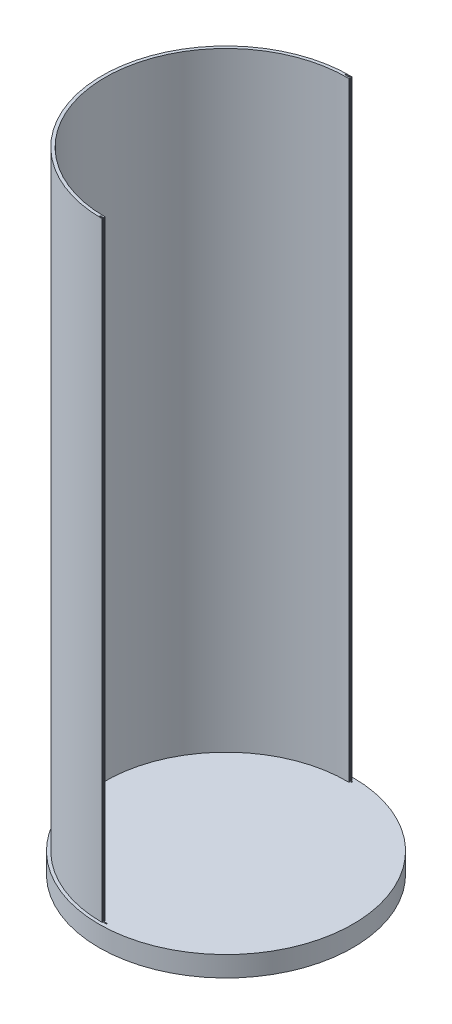
ISO-10303-21;
HEADER;
FILE_DESCRIPTION(('STEP AP214'),'2;1');
FILE_NAME('part.step','',(''),(''),'','','');
FILE_SCHEMA(('AUTOMOTIVE_DESIGN { 1 0 10303 214 1 1 1 1 }'));
ENDSEC;
DATA;
#1=APPLICATION_CONTEXT('core data for automotive mechanical design processes');
#2=APPLICATION_PROTOCOL_DEFINITION('international standard','automotive_design',2000,#1);
#3=PRODUCT_CONTEXT('',#1,'mechanical');
#4=PRODUCT('Part','Part','',(#3));
#5=PRODUCT_RELATED_PRODUCT_CATEGORY('part','',(#4));
#6=PRODUCT_DEFINITION_FORMATION('','',#4);
#7=PRODUCT_DEFINITION_CONTEXT('part definition',#1,'design');
#8=PRODUCT_DEFINITION('design','',#6,#7);
#9=PRODUCT_DEFINITION_SHAPE('','',#8);
#10=(LENGTH_UNIT() NAMED_UNIT(*) SI_UNIT(.MILLI.,.METRE.));
#11=(NAMED_UNIT(*) PLANE_ANGLE_UNIT() SI_UNIT($,.RADIAN.));
#12=(NAMED_UNIT(*) SI_UNIT($,.STERADIAN.) SOLID_ANGLE_UNIT());
#13=UNCERTAINTY_MEASURE_WITH_UNIT(LENGTH_MEASURE(1.E-05),#10,'distance_accuracy_value','');
#14=(GEOMETRIC_REPRESENTATION_CONTEXT(3) GLOBAL_UNCERTAINTY_ASSIGNED_CONTEXT((#13)) GLOBAL_UNIT_ASSIGNED_CONTEXT((#10,
#11,#12)) REPRESENTATION_CONTEXT('',''));
#15=CARTESIAN_POINT('',(0.,0.,0.));
#16=DIRECTION('',(0.,0.,1.));
#17=DIRECTION('',(1.,0.,0.));
#18=AXIS2_PLACEMENT_3D('',#15,#16,#17);
#19=CARTESIAN_POINT('',(0.,10.,0.));
#20=DIRECTION('',(0.,1.,0.));
#21=DIRECTION('',(0.,0.,1.));
#22=AXIS2_PLACEMENT_3D('',#19,#20,#21);
#23=PLANE('',#22);
#24=CARTESIAN_POINT('',(0.,10.,0.));
#25=DIRECTION('',(0.,1.,0.));
#26=DIRECTION('',(0.,0.,1.));
#27=AXIS2_PLACEMENT_3D('',#24,#25,#26);
#28=CIRCLE('',#27,62.5);
#29=CARTESIAN_POINT('',(0.,10.,62.5));
#30=VERTEX_POINT('',#29);
#31=EDGE_CURVE('E267',#30,#30,#28,.T.);
#32=ORIENTED_EDGE('',*,*,#31,.T.);
#33=EDGE_LOOP('',(#32));
#34=FACE_BOUND('',#33,.T.);
#35=DIRECTION('',(-0.0168061206667633,0.,0.999858767180713));
#36=VECTOR('',#35,1.);
#37=CARTESIAN_POINT('',(1.02517336067272,10.,-60.9913847980235));
#38=LINE('',#37,#36);
#39=CARTESIAN_POINT('',(1.02517336067272,10.,-60.9913847980235));
#40=VERTEX_POINT('',#39);
#41=CARTESIAN_POINT('',(1.01895999778819,9.99999999999995,-60.6217286782709));
#42=VERTEX_POINT('',#41);
#43=EDGE_CURVE('E232',#40,#42,#38,.T.);
#44=ORIENTED_EDGE('',*,*,#43,.T.);
#45=DIRECTION('',(1.,0.,0.));
#46=VECTOR('',#45,1.);
#47=CARTESIAN_POINT('',(0.,10.,-60.6217286782709));
#48=LINE('',#47,#46);
#49=CARTESIAN_POINT('',(1.71149518291713,10.,-60.6217286782709));
#50=VERTEX_POINT('',#49);
#51=EDGE_CURVE('E183',#42,#50,#48,.T.);
#52=ORIENTED_EDGE('',*,*,#51,.T.);
#53=DIRECTION('',(0.,0.,1.));
#54=VECTOR('',#53,1.);
#55=CARTESIAN_POINT('',(1.71149518291713,10.,0.));
#56=LINE('',#55,#54);
#57=CARTESIAN_POINT('',(1.71149518291713,10.,-60.1397457254507));
#58=VERTEX_POINT('',#57);
#59=EDGE_CURVE('E186',#50,#58,#56,.T.);
#60=ORIENTED_EDGE('',*,*,#59,.T.);
#61=DIRECTION('',(-1.,0.,0.));
#62=VECTOR('',#61,1.);
#63=CARTESIAN_POINT('',(0.,10.,-60.1397457254507));
#64=LINE('',#63,#62);
#65=CARTESIAN_POINT('',(1.0108585899391,9.99999999999995,-60.1397457254507));
#66=VERTEX_POINT('',#65);
#67=EDGE_CURVE('E177',#58,#66,#64,.T.);
#68=ORIENTED_EDGE('',*,*,#67,.T.);
#69=CARTESIAN_POINT('',(0.999964179672416,10.,-59.4915966472524));
#70=VERTEX_POINT('',#69);
#71=EDGE_CURVE('E252',#66,#70,#38,.T.);
#72=ORIENTED_EDGE('',*,*,#71,.T.);
#73=CARTESIAN_POINT('',(0.,10.,0.));
#74=DIRECTION('',(0.,1.,0.));
#75=DIRECTION('',(0.,0.,1.));
#76=AXIS2_PLACEMENT_3D('',#73,#74,#75);
#77=CIRCLE('',#76,59.5);
#78=CARTESIAN_POINT('',(0.,10.,59.5));
#79=VERTEX_POINT('',#78);
#80=EDGE_CURVE('E250',#70,#79,#77,.T.);
#81=ORIENTED_EDGE('',*,*,#80,.T.);
#82=DIRECTION('',(0.,0.,1.));
#83=VECTOR('',#82,1.);
#84=CARTESIAN_POINT('',(0.,10.,59.5));
#85=LINE('',#84,#83);
#86=CARTESIAN_POINT('',(0.,9.99999999999995,60.1397457254507));
#87=VERTEX_POINT('',#86);
#88=EDGE_CURVE('E247',#79,#87,#85,.T.);
#89=ORIENTED_EDGE('',*,*,#88,.T.);
#90=DIRECTION('',(-1.,0.,0.));
#91=VECTOR('',#90,1.);
#92=CARTESIAN_POINT('',(0.,10.,60.1397457254507));
#93=LINE('',#92,#91);
#94=CARTESIAN_POINT('',(1.71149518291713,10.,60.1397457254507));
#95=VERTEX_POINT('',#94);
#96=EDGE_CURVE('E223',#95,#87,#93,.T.);
#97=ORIENTED_EDGE('',*,*,#96,.F.);
#98=DIRECTION('',(0.,0.,-1.));
#99=VECTOR('',#98,1.);
#100=CARTESIAN_POINT('',(1.71149518291713,10.,0.));
#101=LINE('',#100,#99);
#102=CARTESIAN_POINT('',(1.71149518291713,10.,60.6217286782709));
#103=VERTEX_POINT('',#102);
#104=EDGE_CURVE('E225',#103,#95,#101,.T.);
#105=ORIENTED_EDGE('',*,*,#104,.F.);
#106=DIRECTION('',(1.,0.,0.));
#107=VECTOR('',#106,1.);
#108=CARTESIAN_POINT('',(0.,10.,60.6217286782709));
#109=LINE('',#108,#107);
#110=CARTESIAN_POINT('',(0.,9.99999999999995,60.6217286782709));
#111=VERTEX_POINT('',#110);
#112=EDGE_CURVE('E219',#111,#103,#109,.T.);
#113=ORIENTED_EDGE('',*,*,#112,.F.);
#114=CARTESIAN_POINT('',(-4.5569107396273E-13,10.,61.));
#115=VERTEX_POINT('',#114);
#116=EDGE_CURVE('E246',#111,#115,#85,.T.);
#117=ORIENTED_EDGE('',*,*,#116,.T.);
#118=CARTESIAN_POINT('',(0.,10.,0.));
#119=DIRECTION('',(0.,1.,0.));
#120=DIRECTION('',(1.,0.,0.));
#121=AXIS2_PLACEMENT_3D('',#118,#119,#120);
#122=CIRCLE('',#121,61.);
#123=EDGE_CURVE('E227',#40,#115,#122,.T.);
#124=ORIENTED_EDGE('',*,*,#123,.F.);
#125=EDGE_LOOP('',(#44,#52,#60,#68,#72,#81,#89,#97,#105,#113,#117,#124));
#126=FACE_BOUND('',#125,.T.);
#127=ADVANCED_FACE('F32',(#34,#126),#23,.T.);
#128=CARTESIAN_POINT('',(0.,0.,0.));
#129=DIRECTION('',(0.,1.,0.));
#130=DIRECTION('',(0.,0.,1.));
#131=AXIS2_PLACEMENT_3D('',#128,#129,#130);
#132=PLANE('',#131);
#133=CARTESIAN_POINT('',(0.,0.,0.));
#134=DIRECTION('',(0.,1.,0.));
#135=DIRECTION('',(0.,0.,1.));
#136=AXIS2_PLACEMENT_3D('',#133,#134,#135);
#137=CIRCLE('',#136,62.5);
#138=CARTESIAN_POINT('',(0.,0.,62.5));
#139=VERTEX_POINT('',#138);
#140=EDGE_CURVE('E266',#139,#139,#137,.T.);
#141=ORIENTED_EDGE('',*,*,#140,.F.);
#142=EDGE_LOOP('',(#141));
#143=FACE_BOUND('',#142,.T.);
#144=DIRECTION('',(-1.,0.,0.));
#145=VECTOR('',#144,1.);
#146=CARTESIAN_POINT('',(-1.62574415284666,0.,60.1397457254507));
#147=LINE('',#146,#145);
#148=CARTESIAN_POINT('',(1.71149518291713,0.,60.1397457254507));
#149=VERTEX_POINT('',#148);
#150=CARTESIAN_POINT('',(-1.62574415284666,0.,60.1397457254507));
#151=VERTEX_POINT('',#150);
#152=EDGE_CURVE('E200',#149,#151,#147,.T.);
#153=ORIENTED_EDGE('',*,*,#152,.T.);
#154=DIRECTION('',(0.,0.,1.));
#155=VECTOR('',#154,1.);
#156=CARTESIAN_POINT('',(-1.62574415284666,0.,60.1397457254507));
#157=LINE('',#156,#155);
#158=CARTESIAN_POINT('',(-1.62574415284666,0.,60.6217286782709));
#159=VERTEX_POINT('',#158);
#160=EDGE_CURVE('E190',#151,#159,#157,.T.);
#161=ORIENTED_EDGE('',*,*,#160,.T.);
#162=DIRECTION('',(1.,0.,0.));
#163=VECTOR('',#162,1.);
#164=CARTESIAN_POINT('',(-1.62574415284666,0.,60.6217286782709));
#165=LINE('',#164,#163);
#166=CARTESIAN_POINT('',(1.71149518291713,0.,60.6217286782709));
#167=VERTEX_POINT('',#166);
#168=EDGE_CURVE('E193',#159,#167,#165,.T.);
#169=ORIENTED_EDGE('',*,*,#168,.T.);
#170=DIRECTION('',(0.,0.,-1.));
#171=VECTOR('',#170,1.);
#172=CARTESIAN_POINT('',(1.71149518291713,0.,60.1397457254507));
#173=LINE('',#172,#171);
#174=EDGE_CURVE('E197',#167,#149,#173,.T.);
#175=ORIENTED_EDGE('',*,*,#174,.T.);
#176=EDGE_LOOP('',(#153,#161,#169,#175));
#177=FACE_BOUND('',#176,.T.);
#178=DIRECTION('',(0.,0.,-1.));
#179=VECTOR('',#178,1.);
#180=CARTESIAN_POINT('',(-1.62574415284666,0.,-60.1397457254507));
#181=LINE('',#180,#179);
#182=CARTESIAN_POINT('',(-1.62574415284666,0.,-60.1397457254507));
#183=VERTEX_POINT('',#182);
#184=CARTESIAN_POINT('',(-1.62574415284666,0.,-60.6217286782709));
#185=VERTEX_POINT('',#184);
#186=EDGE_CURVE('E152',#183,#185,#181,.T.);
#187=ORIENTED_EDGE('',*,*,#186,.F.);
#188=DIRECTION('',(-1.,0.,0.));
#189=VECTOR('',#188,1.);
#190=CARTESIAN_POINT('',(-1.62574415284666,0.,-60.1397457254507));
#191=LINE('',#190,#189);
#192=CARTESIAN_POINT('',(1.71149518291713,0.,-60.1397457254507));
#193=VERTEX_POINT('',#192);
#194=EDGE_CURVE('E145',#193,#183,#191,.T.);
#195=ORIENTED_EDGE('',*,*,#194,.F.);
#196=DIRECTION('',(0.,0.,1.));
#197=VECTOR('',#196,1.);
#198=CARTESIAN_POINT('',(1.71149518291713,0.,-60.1397457254507));
#199=LINE('',#198,#197);
#200=CARTESIAN_POINT('',(1.71149518291713,0.,-60.6217286782709));
#201=VERTEX_POINT('',#200);
#202=EDGE_CURVE('E151',#201,#193,#199,.T.);
#203=ORIENTED_EDGE('',*,*,#202,.F.);
#204=DIRECTION('',(1.,0.,0.));
#205=VECTOR('',#204,1.);
#206=CARTESIAN_POINT('',(-1.62574415284666,0.,-60.6217286782709));
#207=LINE('',#206,#205);
#208=EDGE_CURVE('E156',#185,#201,#207,.T.);
#209=ORIENTED_EDGE('',*,*,#208,.F.);
#210=EDGE_LOOP('',(#187,#195,#203,#209));
#211=FACE_BOUND('',#210,.T.);
#212=ADVANCED_FACE('F159',(#143,#177,#211),#132,.F.);
#213=CARTESIAN_POINT('',(1.02517336067272,310.,-60.9913847980235));
#214=DIRECTION('',(0.999858767180712,0.,0.0168061206667633));
#215=DIRECTION('',(0.0168061206667633,0.,-0.999858767180712));
#216=AXIS2_PLACEMENT_3D('',#213,#214,#215);
#217=PLANE('',#216);
#218=DIRECTION('',(-0.0168061206667633,0.,0.999858767180713));
#219=VECTOR('',#218,1.);
#220=CARTESIAN_POINT('',(1.02517336067272,310.,-60.9913847980235));
#221=LINE('',#220,#219);
#222=CARTESIAN_POINT('',(1.02517336067272,310.,-60.9913847980235));
#223=VERTEX_POINT('',#222);
#224=CARTESIAN_POINT('',(1.01895999778819,310.,-60.6217286782709));
#225=VERTEX_POINT('',#224);
#226=EDGE_CURVE('E240',#223,#225,#221,.T.);
#227=ORIENTED_EDGE('',*,*,#226,.T.);
#228=DIRECTION('',(0.,-1.,0.));
#229=VECTOR('',#228,1.);
#230=CARTESIAN_POINT('',(1.01895999778819,310.,-60.6217286782709));
#231=LINE('',#230,#229);
#232=EDGE_CURVE('E180',#225,#42,#231,.T.);
#233=ORIENTED_EDGE('',*,*,#232,.T.);
#234=ORIENTED_EDGE('',*,*,#43,.F.);
#235=DIRECTION('',(0.,-1.,0.));
#236=VECTOR('',#235,1.);
#237=CARTESIAN_POINT('',(1.02517336067272,310.,-60.9913847980235));
#238=LINE('',#237,#236);
#239=EDGE_CURVE('E243',#223,#40,#238,.T.);
#240=ORIENTED_EDGE('',*,*,#239,.F.);
#241=EDGE_LOOP('',(#227,#233,#234,#240));
#242=FACE_BOUND('',#241,.T.);
#243=ADVANCED_FACE('F320',(#242),#217,.T.);
#244=ORIENTED_EDGE('',*,*,#71,.F.);
#245=DIRECTION('',(0.,1.,0.));
#246=VECTOR('',#245,1.);
#247=CARTESIAN_POINT('',(1.0108585899391,310.,-60.1397457254507));
#248=LINE('',#247,#246);
#249=CARTESIAN_POINT('',(1.0108585899391,310.,-60.1397457254507));
#250=VERTEX_POINT('',#249);
#251=EDGE_CURVE('E170',#66,#250,#248,.T.);
#252=ORIENTED_EDGE('',*,*,#251,.T.);
#253=CARTESIAN_POINT('',(0.999964179672573,310.,-59.4915966472524));
#254=VERTEX_POINT('',#253);
#255=EDGE_CURVE('E239',#250,#254,#221,.T.);
#256=ORIENTED_EDGE('',*,*,#255,.T.);
#257=DIRECTION('',(0.,-1.,0.));
#258=VECTOR('',#257,1.);
#259=CARTESIAN_POINT('',(0.999964179672573,310.,-59.4915966472524));
#260=LINE('',#259,#258);
#261=EDGE_CURVE('E257',#254,#70,#260,.T.);
#262=ORIENTED_EDGE('',*,*,#261,.T.);
#263=EDGE_LOOP('',(#244,#252,#256,#262));
#264=FACE_BOUND('',#263,.T.);
#265=ADVANCED_FACE('F312',(#264),#217,.T.);
#266=CARTESIAN_POINT('',(0.,310.,0.));
#267=DIRECTION('',(0.,1.,0.));
#268=DIRECTION('',(1.,0.,0.));
#269=AXIS2_PLACEMENT_3D('',#266,#267,#268);
#270=PLANE('',#269);
#271=DIRECTION('',(0.,0.,-1.));
#272=VECTOR('',#271,1.);
#273=CARTESIAN_POINT('',(-1.62574415284666,310.,-60.1397457254507));
#274=LINE('',#273,#272);
#275=CARTESIAN_POINT('',(-1.62574415284666,310.,-60.1397457254507));
#276=VERTEX_POINT('',#275);
#277=CARTESIAN_POINT('',(-1.62574415284666,310.,-60.6217286782709));
#278=VERTEX_POINT('',#277);
#279=EDGE_CURVE('E55',#276,#278,#274,.T.);
#280=ORIENTED_EDGE('',*,*,#279,.T.);
#281=DIRECTION('',(1.,0.,0.));
#282=VECTOR('',#281,1.);
#283=CARTESIAN_POINT('',(-1.62574415284666,310.,-60.6217286782709));
#284=LINE('',#283,#282);
#285=EDGE_CURVE('E160',#278,#225,#284,.T.);
#286=ORIENTED_EDGE('',*,*,#285,.T.);
#287=ORIENTED_EDGE('',*,*,#226,.F.);
#288=CARTESIAN_POINT('',(0.,310.,0.));
#289=DIRECTION('',(0.,1.,0.));
#290=DIRECTION('',(1.,0.,0.));
#291=AXIS2_PLACEMENT_3D('',#288,#289,#290);
#292=CIRCLE('',#291,61.);
#293=CARTESIAN_POINT('',(0.,310.,61.));
#294=VERTEX_POINT('',#293);
#295=EDGE_CURVE('E228',#223,#294,#292,.T.);
#296=ORIENTED_EDGE('',*,*,#295,.T.);
#297=DIRECTION('',(0.,0.,1.));
#298=VECTOR('',#297,1.);
#299=CARTESIAN_POINT('',(0.,310.,59.5));
#300=LINE('',#299,#298);
#301=CARTESIAN_POINT('',(0.,310.,60.6217286782709));
#302=VERTEX_POINT('',#301);
#303=EDGE_CURVE('E231',#302,#294,#300,.T.);
#304=ORIENTED_EDGE('',*,*,#303,.F.);
#305=DIRECTION('',(1.,0.,0.));
#306=VECTOR('',#305,1.);
#307=CARTESIAN_POINT('',(-1.62574415284666,310.,60.6217286782709));
#308=LINE('',#307,#306);
#309=CARTESIAN_POINT('',(-1.62574415284666,310.,60.6217286782709));
#310=VERTEX_POINT('',#309);
#311=EDGE_CURVE('E194',#310,#302,#308,.T.);
#312=ORIENTED_EDGE('',*,*,#311,.F.);
#313=DIRECTION('',(0.,0.,1.));
#314=VECTOR('',#313,1.);
#315=CARTESIAN_POINT('',(-1.62574415284666,310.,60.1397457254507));
#316=LINE('',#315,#314);
#317=CARTESIAN_POINT('',(-1.62574415284666,310.,60.1397457254507));
#318=VERTEX_POINT('',#317);
#319=EDGE_CURVE('E189',#318,#310,#316,.T.);
#320=ORIENTED_EDGE('',*,*,#319,.F.);
#321=DIRECTION('',(-1.,0.,0.));
#322=VECTOR('',#321,1.);
#323=CARTESIAN_POINT('',(0.,310.,60.1397457254507));
#324=LINE('',#323,#322);
#325=CARTESIAN_POINT('',(0.,310.,60.1397457254507));
#326=VERTEX_POINT('',#325);
#327=EDGE_CURVE('E40',#326,#318,#324,.T.);
#328=ORIENTED_EDGE('',*,*,#327,.F.);
#329=CARTESIAN_POINT('',(0.,310.,59.5));
#330=VERTEX_POINT('',#329);
#331=EDGE_CURVE('E233',#330,#326,#300,.T.);
#332=ORIENTED_EDGE('',*,*,#331,.F.);
#333=CARTESIAN_POINT('',(0.,310.,0.));
#334=DIRECTION('',(0.,1.,0.));
#335=DIRECTION('',(0.,0.,1.));
#336=AXIS2_PLACEMENT_3D('',#333,#334,#335);
#337=CIRCLE('',#336,59.5);
#338=EDGE_CURVE('E236',#254,#330,#337,.T.);
#339=ORIENTED_EDGE('',*,*,#338,.F.);
#340=ORIENTED_EDGE('',*,*,#255,.F.);
#341=DIRECTION('',(-1.,0.,0.));
#342=VECTOR('',#341,1.);
#343=CARTESIAN_POINT('',(0.,310.,-60.1397457254507));
#344=LINE('',#343,#342);
#345=EDGE_CURVE('E11',#250,#276,#344,.T.);
#346=ORIENTED_EDGE('',*,*,#345,.T.);
#347=EDGE_LOOP('',(#280,#286,#287,#296,#304,#312,#320,#328,#332,#339,#340,#346));
#348=FACE_BOUND('',#347,.T.);
#349=ADVANCED_FACE('F283',(#348),#270,.T.);
#350=CARTESIAN_POINT('',(0.,310.,59.5));
#351=DIRECTION('',(1.,0.,0.));
#352=DIRECTION('',(0.,0.,-1.));
#353=AXIS2_PLACEMENT_3D('',#350,#351,#352);
#354=PLANE('',#353);
#355=DIRECTION('',(0.,1.,0.));
#356=VECTOR('',#355,1.);
#357=CARTESIAN_POINT('',(0.,310.,60.1397457254507));
#358=LINE('',#357,#356);
#359=EDGE_CURVE('E221',#87,#326,#358,.T.);
#360=ORIENTED_EDGE('',*,*,#359,.F.);
#361=ORIENTED_EDGE('',*,*,#88,.F.);
#362=DIRECTION('',(0.,-1.,0.));
#363=VECTOR('',#362,1.);
#364=CARTESIAN_POINT('',(0.,310.,59.5));
#365=LINE('',#364,#363);
#366=EDGE_CURVE('E260',#330,#79,#365,.T.);
#367=ORIENTED_EDGE('',*,*,#366,.F.);
#368=ORIENTED_EDGE('',*,*,#331,.T.);
#369=EDGE_LOOP('',(#360,#361,#367,#368));
#370=FACE_BOUND('',#369,.T.);
#371=ADVANCED_FACE('F304',(#370),#354,.T.);
#372=CARTESIAN_POINT('',(0.,10.,0.));
#373=DIRECTION('',(0.,-1.,0.));
#374=DIRECTION('',(0.,0.,-1.));
#375=AXIS2_PLACEMENT_3D('',#372,#373,#374);
#376=CYLINDRICAL_SURFACE('',#375,62.5);
#377=ORIENTED_EDGE('',*,*,#31,.F.);
#378=EDGE_LOOP('',(#377));
#379=FACE_BOUND('',#378,.T.);
#380=ORIENTED_EDGE('',*,*,#140,.T.);
#381=EDGE_LOOP('',(#380));
#382=FACE_BOUND('',#381,.T.);
#383=ADVANCED_FACE('F34',(#379,#382),#376,.T.);
#384=CARTESIAN_POINT('',(0.,310.,0.));
#385=DIRECTION('',(0.,-1.,0.));
#386=DIRECTION('',(0.,0.,-1.));
#387=AXIS2_PLACEMENT_3D('',#384,#385,#386);
#388=CYLINDRICAL_SURFACE('',#387,61.);
#389=ORIENTED_EDGE('',*,*,#123,.T.);
#390=DIRECTION('',(0.,-1.,0.));
#391=VECTOR('',#390,1.);
#392=CARTESIAN_POINT('',(0.,310.,61.));
#393=LINE('',#392,#391);
#394=EDGE_CURVE('E263',#294,#115,#393,.T.);
#395=ORIENTED_EDGE('',*,*,#394,.F.);
#396=ORIENTED_EDGE('',*,*,#295,.F.);
#397=ORIENTED_EDGE('',*,*,#239,.T.);
#398=EDGE_LOOP('',(#389,#395,#396,#397));
#399=FACE_BOUND('',#398,.T.);
#400=ADVANCED_FACE('F324',(#399),#388,.T.);
#401=DIRECTION('',(0.,-1.,0.));
#402=VECTOR('',#401,1.);
#403=CARTESIAN_POINT('',(0.,310.,60.6217286782709));
#404=LINE('',#403,#402);
#405=EDGE_CURVE('E209',#302,#111,#404,.T.);
#406=ORIENTED_EDGE('',*,*,#405,.F.);
#407=ORIENTED_EDGE('',*,*,#303,.T.);
#408=ORIENTED_EDGE('',*,*,#394,.T.);
#409=ORIENTED_EDGE('',*,*,#116,.F.);
#410=EDGE_LOOP('',(#406,#407,#408,#409));
#411=FACE_BOUND('',#410,.T.);
#412=ADVANCED_FACE('F292',(#411),#354,.T.);
#413=CARTESIAN_POINT('',(0.,310.,0.));
#414=DIRECTION('',(0.,-1.,0.));
#415=DIRECTION('',(0.,0.,-1.));
#416=AXIS2_PLACEMENT_3D('',#413,#414,#415);
#417=CYLINDRICAL_SURFACE('',#416,59.5);
#418=ORIENTED_EDGE('',*,*,#80,.F.);
#419=ORIENTED_EDGE('',*,*,#261,.F.);
#420=ORIENTED_EDGE('',*,*,#338,.T.);
#421=ORIENTED_EDGE('',*,*,#366,.T.);
#422=EDGE_LOOP('',(#418,#419,#420,#421));
#423=FACE_BOUND('',#422,.T.);
#424=ADVANCED_FACE('F309',(#423),#417,.F.);
#425=CARTESIAN_POINT('',(-1.62574415284666,0.,60.1397457254507));
#426=DIRECTION('',(-1.,0.,0.));
#427=DIRECTION('',(0.,0.,1.));
#428=AXIS2_PLACEMENT_3D('',#425,#426,#427);
#429=PLANE('',#428);
#430=ORIENTED_EDGE('',*,*,#319,.T.);
#431=DIRECTION('',(0.,1.,0.));
#432=VECTOR('',#431,1.);
#433=CARTESIAN_POINT('',(-1.62574415284666,0.,60.6217286782709));
#434=LINE('',#433,#432);
#435=EDGE_CURVE('E203',#159,#310,#434,.T.);
#436=ORIENTED_EDGE('',*,*,#435,.F.);
#437=ORIENTED_EDGE('',*,*,#160,.F.);
#438=DIRECTION('',(0.,1.,0.));
#439=VECTOR('',#438,1.);
#440=CARTESIAN_POINT('',(-1.62574415284666,0.,60.1397457254507));
#441=LINE('',#440,#439);
#442=EDGE_CURVE('E206',#151,#318,#441,.T.);
#443=ORIENTED_EDGE('',*,*,#442,.T.);
#444=EDGE_LOOP('',(#430,#436,#437,#443));
#445=FACE_BOUND('',#444,.T.);
#446=ADVANCED_FACE('F281',(#445),#429,.F.);
#447=CARTESIAN_POINT('',(-1.62574415284666,0.,60.1397457254507));
#448=DIRECTION('',(0.,0.,-1.));
#449=DIRECTION('',(-1.,0.,0.));
#450=AXIS2_PLACEMENT_3D('',#447,#448,#449);
#451=PLANE('',#450);
#452=ORIENTED_EDGE('',*,*,#96,.T.);
#453=ORIENTED_EDGE('',*,*,#359,.T.);
#454=ORIENTED_EDGE('',*,*,#327,.T.);
#455=ORIENTED_EDGE('',*,*,#442,.F.);
#456=ORIENTED_EDGE('',*,*,#152,.F.);
#457=DIRECTION('',(0.,1.,0.));
#458=VECTOR('',#457,1.);
#459=CARTESIAN_POINT('',(1.71149518291713,0.,60.1397457254507));
#460=LINE('',#459,#458);
#461=EDGE_CURVE('E210',#149,#95,#460,.T.);
#462=ORIENTED_EDGE('',*,*,#461,.T.);
#463=EDGE_LOOP('',(#452,#453,#454,#455,#456,#462));
#464=FACE_BOUND('',#463,.T.);
#465=ADVANCED_FACE('F273',(#464),#451,.F.);
#466=CARTESIAN_POINT('',(1.71149518291713,0.,60.1397457254507));
#467=DIRECTION('',(1.,0.,0.));
#468=DIRECTION('',(0.,0.,-1.));
#469=AXIS2_PLACEMENT_3D('',#466,#467,#468);
#470=PLANE('',#469);
#471=ORIENTED_EDGE('',*,*,#104,.T.);
#472=ORIENTED_EDGE('',*,*,#461,.F.);
#473=ORIENTED_EDGE('',*,*,#174,.F.);
#474=DIRECTION('',(0.,1.,0.));
#475=VECTOR('',#474,1.);
#476=CARTESIAN_POINT('',(1.71149518291713,0.,60.6217286782709));
#477=LINE('',#476,#475);
#478=EDGE_CURVE('E213',#167,#103,#477,.T.);
#479=ORIENTED_EDGE('',*,*,#478,.T.);
#480=EDGE_LOOP('',(#471,#472,#473,#479));
#481=FACE_BOUND('',#480,.T.);
#482=ADVANCED_FACE('F299',(#481),#470,.F.);
#483=CARTESIAN_POINT('',(-1.62574415284666,0.,60.6217286782709));
#484=DIRECTION('',(0.,0.,1.));
#485=DIRECTION('',(1.,0.,0.));
#486=AXIS2_PLACEMENT_3D('',#483,#484,#485);
#487=PLANE('',#486);
#488=ORIENTED_EDGE('',*,*,#112,.T.);
#489=ORIENTED_EDGE('',*,*,#478,.F.);
#490=ORIENTED_EDGE('',*,*,#168,.F.);
#491=ORIENTED_EDGE('',*,*,#435,.T.);
#492=ORIENTED_EDGE('',*,*,#311,.T.);
#493=ORIENTED_EDGE('',*,*,#405,.T.);
#494=EDGE_LOOP('',(#488,#489,#490,#491,#492,#493));
#495=FACE_BOUND('',#494,.T.);
#496=ADVANCED_FACE('F287',(#495),#487,.F.);
#497=CARTESIAN_POINT('',(-1.62574415284666,0.,-60.1397457254507));
#498=DIRECTION('',(1.,0.,0.));
#499=DIRECTION('',(0.,0.,-1.));
#500=AXIS2_PLACEMENT_3D('',#497,#498,#499);
#501=PLANE('',#500);
#502=ORIENTED_EDGE('',*,*,#279,.F.);
#503=DIRECTION('',(0.,1.,0.));
#504=VECTOR('',#503,1.);
#505=CARTESIAN_POINT('',(-1.62574415284666,0.,-60.1397457254507));
#506=LINE('',#505,#504);
#507=EDGE_CURVE('E147',#183,#276,#506,.T.);
#508=ORIENTED_EDGE('',*,*,#507,.F.);
#509=ORIENTED_EDGE('',*,*,#186,.T.);
#510=DIRECTION('',(0.,1.,0.));
#511=VECTOR('',#510,1.);
#512=CARTESIAN_POINT('',(-1.62574415284666,0.,-60.6217286782709));
#513=LINE('',#512,#511);
#514=EDGE_CURVE('E168',#185,#278,#513,.T.);
#515=ORIENTED_EDGE('',*,*,#514,.T.);
#516=EDGE_LOOP('',(#502,#508,#509,#515));
#517=FACE_BOUND('',#516,.T.);
#518=ADVANCED_FACE('F154',(#517),#501,.T.);
#519=CARTESIAN_POINT('',(-1.62574415284666,0.,-60.6217286782709));
#520=DIRECTION('',(0.,0.,1.));
#521=DIRECTION('',(1.,0.,0.));
#522=AXIS2_PLACEMENT_3D('',#519,#520,#521);
#523=PLANE('',#522);
#524=ORIENTED_EDGE('',*,*,#232,.F.);
#525=ORIENTED_EDGE('',*,*,#285,.F.);
#526=ORIENTED_EDGE('',*,*,#514,.F.);
#527=ORIENTED_EDGE('',*,*,#208,.T.);
#528=DIRECTION('',(0.,1.,0.));
#529=VECTOR('',#528,1.);
#530=CARTESIAN_POINT('',(1.71149518291713,0.,-60.6217286782709));
#531=LINE('',#530,#529);
#532=EDGE_CURVE('E171',#201,#50,#531,.T.);
#533=ORIENTED_EDGE('',*,*,#532,.T.);
#534=ORIENTED_EDGE('',*,*,#51,.F.);
#535=EDGE_LOOP('',(#524,#525,#526,#527,#533,#534));
#536=FACE_BOUND('',#535,.T.);
#537=ADVANCED_FACE('F317',(#536),#523,.T.);
#538=CARTESIAN_POINT('',(1.71149518291713,0.,-60.1397457254507));
#539=DIRECTION('',(-1.,0.,0.));
#540=DIRECTION('',(0.,0.,1.));
#541=AXIS2_PLACEMENT_3D('',#538,#539,#540);
#542=PLANE('',#541);
#543=ORIENTED_EDGE('',*,*,#532,.F.);
#544=ORIENTED_EDGE('',*,*,#202,.T.);
#545=DIRECTION('',(0.,1.,0.));
#546=VECTOR('',#545,1.);
#547=CARTESIAN_POINT('',(1.71149518291713,0.,-60.1397457254507));
#548=LINE('',#547,#546);
#549=EDGE_CURVE('E47',#193,#58,#548,.T.);
#550=ORIENTED_EDGE('',*,*,#549,.T.);
#551=ORIENTED_EDGE('',*,*,#59,.F.);
#552=EDGE_LOOP('',(#543,#544,#550,#551));
#553=FACE_BOUND('',#552,.T.);
#554=ADVANCED_FACE('F315',(#553),#542,.T.);
#555=CARTESIAN_POINT('',(-1.62574415284666,0.,-60.1397457254507));
#556=DIRECTION('',(0.,0.,-1.));
#557=DIRECTION('',(-1.,0.,0.));
#558=AXIS2_PLACEMENT_3D('',#555,#556,#557);
#559=PLANE('',#558);
#560=ORIENTED_EDGE('',*,*,#549,.F.);
#561=ORIENTED_EDGE('',*,*,#194,.T.);
#562=ORIENTED_EDGE('',*,*,#507,.T.);
#563=ORIENTED_EDGE('',*,*,#345,.F.);
#564=ORIENTED_EDGE('',*,*,#251,.F.);
#565=ORIENTED_EDGE('',*,*,#67,.F.);
#566=EDGE_LOOP('',(#560,#561,#562,#563,#564,#565));
#567=FACE_BOUND('',#566,.T.);
#568=ADVANCED_FACE('F146',(#567),#559,.T.);
#569=CLOSED_SHELL('',(#127,#212,#243,#265,#349,#371,#383,#400,#412,#424,#446,#465,#482,#496,
#518,#537,#554,#568));
#570=MANIFOLD_SOLID_BREP('B2',#569);
#571=ADVANCED_BREP_SHAPE_REPRESENTATION('',(#18,#570),#14);
#572=SHAPE_DEFINITION_REPRESENTATION(#9,#571);
ENDSEC;
END-ISO-10303-21;
